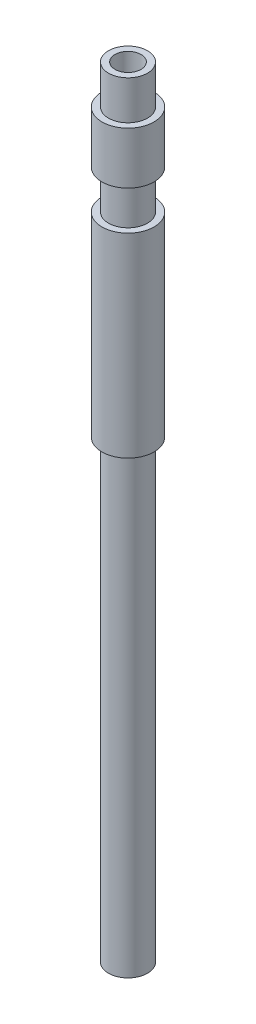
ISO-10303-21;
HEADER;
FILE_DESCRIPTION(('STEP AP214'),'2;1');
FILE_NAME('part.step','',(''),(''),'','','');
FILE_SCHEMA(('AUTOMOTIVE_DESIGN { 1 0 10303 214 1 1 1 1 }'));
ENDSEC;
DATA;
#1=APPLICATION_CONTEXT('core data for automotive mechanical design processes');
#2=APPLICATION_PROTOCOL_DEFINITION('international standard','automotive_design',2000,#1);
#3=PRODUCT_CONTEXT('',#1,'mechanical');
#4=PRODUCT('Part','Part','',(#3));
#5=PRODUCT_RELATED_PRODUCT_CATEGORY('part','',(#4));
#6=PRODUCT_DEFINITION_FORMATION('','',#4);
#7=PRODUCT_DEFINITION_CONTEXT('part definition',#1,'design');
#8=PRODUCT_DEFINITION('design','',#6,#7);
#9=PRODUCT_DEFINITION_SHAPE('','',#8);
#10=(LENGTH_UNIT() NAMED_UNIT(*) SI_UNIT(.MILLI.,.METRE.));
#11=(NAMED_UNIT(*) PLANE_ANGLE_UNIT() SI_UNIT($,.RADIAN.));
#12=(NAMED_UNIT(*) SI_UNIT($,.STERADIAN.) SOLID_ANGLE_UNIT());
#13=UNCERTAINTY_MEASURE_WITH_UNIT(LENGTH_MEASURE(1.E-05),#10,'distance_accuracy_value','');
#14=(GEOMETRIC_REPRESENTATION_CONTEXT(3) GLOBAL_UNCERTAINTY_ASSIGNED_CONTEXT((#13)) GLOBAL_UNIT_ASSIGNED_CONTEXT((#10,
#11,#12)) REPRESENTATION_CONTEXT('',''));
#15=CARTESIAN_POINT('',(0.,0.,0.));
#16=DIRECTION('',(0.,0.,1.));
#17=DIRECTION('',(1.,0.,0.));
#18=AXIS2_PLACEMENT_3D('',#15,#16,#17);
#19=CARTESIAN_POINT('',(0.,0.,0.));
#20=DIRECTION('',(0.,1.,0.));
#21=DIRECTION('',(0.,0.,1.));
#22=AXIS2_PLACEMENT_3D('',#19,#20,#21);
#23=PLANE('',#22);
#24=CARTESIAN_POINT('',(0.,0.,0.));
#25=DIRECTION('',(0.,1.,0.));
#26=DIRECTION('',(0.,0.,1.));
#27=AXIS2_PLACEMENT_3D('',#24,#25,#26);
#28=CIRCLE('',#27,1.);
#29=CARTESIAN_POINT('',(0.,0.,1.));
#30=VERTEX_POINT('',#29);
#31=EDGE_CURVE('E36',#30,#30,#28,.T.);
#32=ORIENTED_EDGE('',*,*,#31,.T.);
#33=EDGE_LOOP('',(#32));
#34=FACE_BOUND('',#33,.T.);
#35=CARTESIAN_POINT('',(0.,0.,0.));
#36=DIRECTION('',(0.,-1.,0.));
#37=DIRECTION('',(0.,0.,-1.));
#38=AXIS2_PLACEMENT_3D('',#35,#36,#37);
#39=CIRCLE('',#38,1.5);
#40=CARTESIAN_POINT('',(0.,0.,-1.5));
#41=VERTEX_POINT('',#40);
#42=EDGE_CURVE('E71',#41,#41,#39,.T.);
#43=ORIENTED_EDGE('',*,*,#42,.T.);
#44=EDGE_LOOP('',(#43));
#45=FACE_BOUND('',#44,.T.);
#46=ADVANCED_FACE('F32',(#34,#45),#23,.F.);
#47=CARTESIAN_POINT('',(0.,60.,0.));
#48=DIRECTION('',(0.,-1.,0.));
#49=DIRECTION('',(0.,0.,-1.));
#50=AXIS2_PLACEMENT_3D('',#47,#48,#49);
#51=CYLINDRICAL_SURFACE('',#50,2.);
#52=CARTESIAN_POINT('',(0.,35.,0.));
#53=DIRECTION('',(0.,-1.,0.));
#54=DIRECTION('',(0.,0.,-1.));
#55=AXIS2_PLACEMENT_3D('',#52,#53,#54);
#56=CIRCLE('',#55,1.99999999999999);
#57=CARTESIAN_POINT('',(0.,35.,-1.99999999999999));
#58=VERTEX_POINT('',#57);
#59=EDGE_CURVE('E65',#58,#58,#56,.T.);
#60=ORIENTED_EDGE('',*,*,#59,.F.);
#61=EDGE_LOOP('',(#60));
#62=FACE_BOUND('',#61,.T.);
#63=CARTESIAN_POINT('',(0.,50.,0.));
#64=DIRECTION('',(0.,1.,0.));
#65=DIRECTION('',(0.,0.,1.));
#66=AXIS2_PLACEMENT_3D('',#63,#64,#65);
#67=CIRCLE('',#66,2.);
#68=CARTESIAN_POINT('',(0.,50.,2.));
#69=VERTEX_POINT('',#68);
#70=EDGE_CURVE('E53',#69,#69,#67,.T.);
#71=ORIENTED_EDGE('',*,*,#70,.F.);
#72=EDGE_LOOP('',(#71));
#73=FACE_BOUND('',#72,.T.);
#74=ADVANCED_FACE('F34',(#62,#73),#51,.T.);
#75=CARTESIAN_POINT('',(0.,57.,0.));
#76=DIRECTION('',(0.,1.,0.));
#77=DIRECTION('',(0.,0.,1.));
#78=AXIS2_PLACEMENT_3D('',#75,#76,#77);
#79=CIRCLE('',#78,2.);
#80=CARTESIAN_POINT('',(0.,57.,2.));
#81=VERTEX_POINT('',#80);
#82=EDGE_CURVE('E43',#81,#81,#79,.T.);
#83=ORIENTED_EDGE('',*,*,#82,.F.);
#84=EDGE_LOOP('',(#83));
#85=FACE_BOUND('',#84,.T.);
#86=CARTESIAN_POINT('',(0.,53.,0.));
#87=DIRECTION('',(0.,1.,0.));
#88=DIRECTION('',(0.,0.,1.));
#89=AXIS2_PLACEMENT_3D('',#86,#87,#88);
#90=CIRCLE('',#89,2.);
#91=CARTESIAN_POINT('',(0.,53.,2.));
#92=VERTEX_POINT('',#91);
#93=EDGE_CURVE('E62',#92,#92,#90,.T.);
#94=ORIENTED_EDGE('',*,*,#93,.T.);
#95=EDGE_LOOP('',(#94));
#96=FACE_BOUND('',#95,.T.);
#97=ADVANCED_FACE('F91',(#85,#96),#51,.T.);
#98=CARTESIAN_POINT('',(0.,60.,0.));
#99=DIRECTION('',(0.,1.,0.));
#100=DIRECTION('',(0.,0.,1.));
#101=AXIS2_PLACEMENT_3D('',#98,#99,#100);
#102=PLANE('',#101);
#103=CARTESIAN_POINT('',(0.,60.,0.));
#104=DIRECTION('',(0.,1.,0.));
#105=DIRECTION('',(0.,0.,1.));
#106=AXIS2_PLACEMENT_3D('',#103,#104,#105);
#107=CIRCLE('',#106,1.);
#108=CARTESIAN_POINT('',(0.,60.,1.));
#109=VERTEX_POINT('',#108);
#110=EDGE_CURVE('E10',#109,#109,#107,.T.);
#111=ORIENTED_EDGE('',*,*,#110,.F.);
#112=EDGE_LOOP('',(#111));
#113=FACE_BOUND('',#112,.T.);
#114=CARTESIAN_POINT('',(0.,60.,0.));
#115=DIRECTION('',(0.,1.,0.));
#116=DIRECTION('',(0.,0.,1.));
#117=AXIS2_PLACEMENT_3D('',#114,#115,#116);
#118=CIRCLE('',#117,1.5);
#119=CARTESIAN_POINT('',(0.,60.,1.5));
#120=VERTEX_POINT('',#119);
#121=EDGE_CURVE('E50',#120,#120,#118,.T.);
#122=ORIENTED_EDGE('',*,*,#121,.T.);
#123=EDGE_LOOP('',(#122));
#124=FACE_BOUND('',#123,.T.);
#125=ADVANCED_FACE('F113',(#113,#124),#102,.T.);
#126=CARTESIAN_POINT('',(0.,60.,0.));
#127=DIRECTION('',(0.,-1.,0.));
#128=DIRECTION('',(0.,0.,-1.));
#129=AXIS2_PLACEMENT_3D('',#126,#127,#128);
#130=CYLINDRICAL_SURFACE('',#129,1.);
#131=ORIENTED_EDGE('',*,*,#110,.T.);
#132=EDGE_LOOP('',(#131));
#133=FACE_BOUND('',#132,.T.);
#134=ORIENTED_EDGE('',*,*,#31,.F.);
#135=EDGE_LOOP('',(#134));
#136=FACE_BOUND('',#135,.T.);
#137=ADVANCED_FACE('F118',(#133,#136),#130,.F.);
#138=CARTESIAN_POINT('',(2.,57.,0.));
#139=DIRECTION('',(0.,1.,0.));
#140=DIRECTION('',(0.,0.,1.));
#141=AXIS2_PLACEMENT_3D('',#138,#139,#140);
#142=PLANE('',#141);
#143=ORIENTED_EDGE('',*,*,#82,.T.);
#144=EDGE_LOOP('',(#143));
#145=FACE_BOUND('',#144,.T.);
#146=CARTESIAN_POINT('',(0.,57.,0.));
#147=DIRECTION('',(0.,1.,0.));
#148=DIRECTION('',(0.,0.,1.));
#149=AXIS2_PLACEMENT_3D('',#146,#147,#148);
#150=CIRCLE('',#149,1.5);
#151=CARTESIAN_POINT('',(0.,57.,1.5));
#152=VERTEX_POINT('',#151);
#153=EDGE_CURVE('E47',#152,#152,#150,.T.);
#154=ORIENTED_EDGE('',*,*,#153,.F.);
#155=EDGE_LOOP('',(#154));
#156=FACE_BOUND('',#155,.T.);
#157=ADVANCED_FACE('F129',(#145,#156),#142,.T.);
#158=CARTESIAN_POINT('',(0.,60.,0.));
#159=DIRECTION('',(0.,1.,0.));
#160=DIRECTION('',(0.,0.,1.));
#161=AXIS2_PLACEMENT_3D('',#158,#159,#160);
#162=CYLINDRICAL_SURFACE('',#161,1.5);
#163=ORIENTED_EDGE('',*,*,#153,.T.);
#164=EDGE_LOOP('',(#163));
#165=FACE_BOUND('',#164,.T.);
#166=ORIENTED_EDGE('',*,*,#121,.F.);
#167=EDGE_LOOP('',(#166));
#168=FACE_BOUND('',#167,.T.);
#169=ADVANCED_FACE('F98',(#165,#168),#162,.T.);
#170=CARTESIAN_POINT('',(2.,50.,0.));
#171=DIRECTION('',(0.,1.,0.));
#172=DIRECTION('',(0.,0.,1.));
#173=AXIS2_PLACEMENT_3D('',#170,#171,#172);
#174=PLANE('',#173);
#175=ORIENTED_EDGE('',*,*,#70,.T.);
#176=EDGE_LOOP('',(#175));
#177=FACE_BOUND('',#176,.T.);
#178=CARTESIAN_POINT('',(0.,50.,0.));
#179=DIRECTION('',(0.,1.,0.));
#180=DIRECTION('',(0.,0.,1.));
#181=AXIS2_PLACEMENT_3D('',#178,#179,#180);
#182=CIRCLE('',#181,1.5);
#183=CARTESIAN_POINT('',(0.,50.,1.5));
#184=VERTEX_POINT('',#183);
#185=EDGE_CURVE('E56',#184,#184,#182,.T.);
#186=ORIENTED_EDGE('',*,*,#185,.F.);
#187=EDGE_LOOP('',(#186));
#188=FACE_BOUND('',#187,.T.);
#189=ADVANCED_FACE('F94',(#177,#188),#174,.T.);
#190=CARTESIAN_POINT('',(0.,60.,0.));
#191=DIRECTION('',(0.,1.,0.));
#192=DIRECTION('',(0.,0.,1.));
#193=AXIS2_PLACEMENT_3D('',#190,#191,#192);
#194=CYLINDRICAL_SURFACE('',#193,1.5);
#195=ORIENTED_EDGE('',*,*,#185,.T.);
#196=EDGE_LOOP('',(#195));
#197=FACE_BOUND('',#196,.T.);
#198=CARTESIAN_POINT('',(0.,53.,0.));
#199=DIRECTION('',(0.,1.,0.));
#200=DIRECTION('',(0.,0.,1.));
#201=AXIS2_PLACEMENT_3D('',#198,#199,#200);
#202=CIRCLE('',#201,1.5);
#203=CARTESIAN_POINT('',(0.,53.,1.5));
#204=VERTEX_POINT('',#203);
#205=EDGE_CURVE('E59',#204,#204,#202,.T.);
#206=ORIENTED_EDGE('',*,*,#205,.F.);
#207=EDGE_LOOP('',(#206));
#208=FACE_BOUND('',#207,.T.);
#209=ADVANCED_FACE('F97',(#197,#208),#194,.T.);
#210=CARTESIAN_POINT('',(2.,53.,0.));
#211=DIRECTION('',(0.,-1.,0.));
#212=DIRECTION('',(0.,0.,-1.));
#213=AXIS2_PLACEMENT_3D('',#210,#211,#212);
#214=PLANE('',#213);
#215=ORIENTED_EDGE('',*,*,#205,.T.);
#216=EDGE_LOOP('',(#215));
#217=FACE_BOUND('',#216,.T.);
#218=ORIENTED_EDGE('',*,*,#93,.F.);
#219=EDGE_LOOP('',(#218));
#220=FACE_BOUND('',#219,.T.);
#221=ADVANCED_FACE('F85',(#217,#220),#214,.T.);
#222=CARTESIAN_POINT('',(1.99999999999999,35.,0.));
#223=DIRECTION('',(0.,1.,0.));
#224=DIRECTION('',(0.,0.,1.));
#225=AXIS2_PLACEMENT_3D('',#222,#223,#224);
#226=PLANE('',#225);
#227=CARTESIAN_POINT('',(0.,35.,0.));
#228=DIRECTION('',(0.,-1.,0.));
#229=DIRECTION('',(0.,0.,-1.));
#230=AXIS2_PLACEMENT_3D('',#227,#228,#229);
#231=CIRCLE('',#230,1.49999999999999);
#232=CARTESIAN_POINT('',(0.,35.,-1.49999999999999));
#233=VERTEX_POINT('',#232);
#234=EDGE_CURVE('E68',#233,#233,#231,.T.);
#235=ORIENTED_EDGE('',*,*,#234,.F.);
#236=EDGE_LOOP('',(#235));
#237=FACE_BOUND('',#236,.T.);
#238=ORIENTED_EDGE('',*,*,#59,.T.);
#239=EDGE_LOOP('',(#238));
#240=FACE_BOUND('',#239,.T.);
#241=ADVANCED_FACE('F79',(#237,#240),#226,.F.);
#242=CARTESIAN_POINT('',(0.,0.,0.));
#243=DIRECTION('',(0.,-1.,0.));
#244=DIRECTION('',(0.,0.,-1.));
#245=AXIS2_PLACEMENT_3D('',#242,#243,#244);
#246=CYLINDRICAL_SURFACE('',#245,1.5);
#247=ORIENTED_EDGE('',*,*,#42,.F.);
#248=EDGE_LOOP('',(#247));
#249=FACE_BOUND('',#248,.T.);
#250=ORIENTED_EDGE('',*,*,#234,.T.);
#251=EDGE_LOOP('',(#250));
#252=FACE_BOUND('',#251,.T.);
#253=ADVANCED_FACE('F76',(#249,#252),#246,.T.);
#254=CLOSED_SHELL('',(#46,#74,#97,#125,#137,#157,#169,#189,#209,#221,#241,#253));
#255=MANIFOLD_SOLID_BREP('B2',#254);
#256=ADVANCED_BREP_SHAPE_REPRESENTATION('',(#18,#255),#14);
#257=SHAPE_DEFINITION_REPRESENTATION(#9,#256);
ENDSEC;
END-ISO-10303-21;
